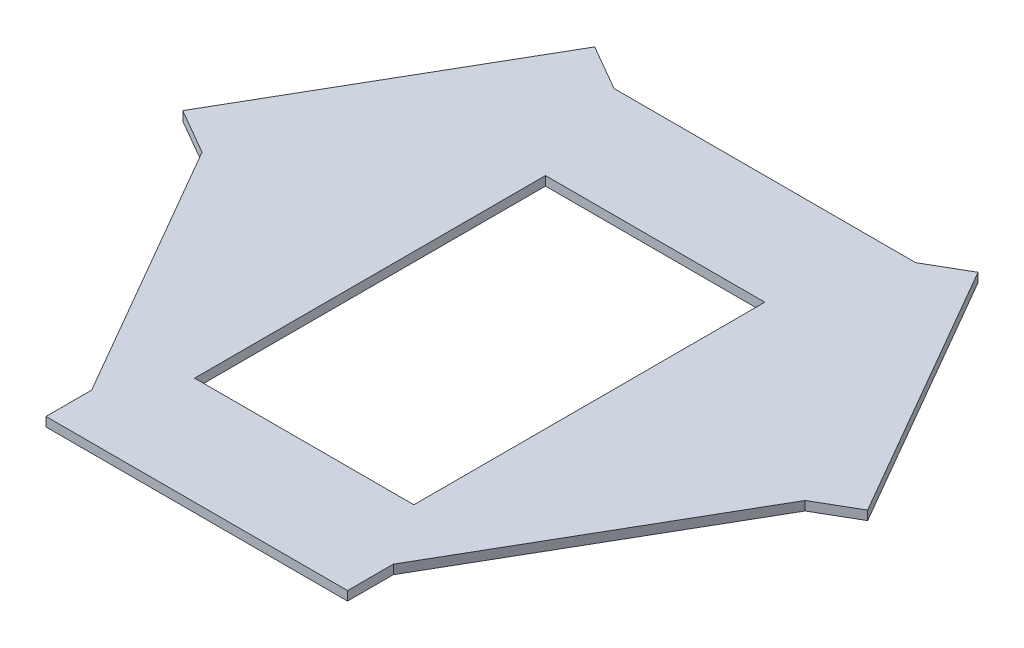
ISO-10303-21;
HEADER;
FILE_DESCRIPTION(('STEP AP214'),'2;1');
FILE_NAME('part.step','',(''),(''),'','','');
FILE_SCHEMA(('AUTOMOTIVE_DESIGN { 1 0 10303 214 1 1 1 1 }'));
ENDSEC;
DATA;
#1=APPLICATION_CONTEXT('core data for automotive mechanical design processes');
#2=APPLICATION_PROTOCOL_DEFINITION('international standard','automotive_design',2000,#1);
#3=PRODUCT_CONTEXT('',#1,'mechanical');
#4=PRODUCT('Part','Part','',(#3));
#5=PRODUCT_RELATED_PRODUCT_CATEGORY('part','',(#4));
#6=PRODUCT_DEFINITION_FORMATION('','',#4);
#7=PRODUCT_DEFINITION_CONTEXT('part definition',#1,'design');
#8=PRODUCT_DEFINITION('design','',#6,#7);
#9=PRODUCT_DEFINITION_SHAPE('','',#8);
#10=(LENGTH_UNIT() NAMED_UNIT(*) SI_UNIT(.MILLI.,.METRE.));
#11=(NAMED_UNIT(*) PLANE_ANGLE_UNIT() SI_UNIT($,.RADIAN.));
#12=(NAMED_UNIT(*) SI_UNIT($,.STERADIAN.) SOLID_ANGLE_UNIT());
#13=UNCERTAINTY_MEASURE_WITH_UNIT(LENGTH_MEASURE(1.E-05),#10,'distance_accuracy_value','');
#14=(GEOMETRIC_REPRESENTATION_CONTEXT(3) GLOBAL_UNCERTAINTY_ASSIGNED_CONTEXT((#13)) GLOBAL_UNIT_ASSIGNED_CONTEXT((#10,
#11,#12)) REPRESENTATION_CONTEXT('',''));
#15=CARTESIAN_POINT('',(0.,0.,0.));
#16=DIRECTION('',(0.,0.,1.));
#17=DIRECTION('',(1.,0.,0.));
#18=AXIS2_PLACEMENT_3D('',#15,#16,#17);
#19=CARTESIAN_POINT('',(-123.75,5.,71.4470958122161));
#20=DIRECTION('',(0.866025403784439,0.,-0.5));
#21=DIRECTION('',(-0.5,0.,-0.866025403784439));
#22=AXIS2_PLACEMENT_3D('',#19,#20,#21);
#23=PLANE('',#22);
#24=DIRECTION('',(0.5,0.,0.866025403784439));
#25=VECTOR('',#24,1.);
#26=CARTESIAN_POINT('',(-123.75,0.,71.4470958122161));
#27=LINE('',#26,#25);
#28=CARTESIAN_POINT('',(-165.,0.,0.));
#29=VERTEX_POINT('',#28);
#30=CARTESIAN_POINT('',(-82.5000000000001,0.,142.894191624432));
#31=VERTEX_POINT('',#30);
#32=EDGE_CURVE('E197',#29,#31,#27,.T.);
#33=ORIENTED_EDGE('',*,*,#32,.T.);
#34=DIRECTION('',(0.,-1.,0.));
#35=VECTOR('',#34,1.);
#36=CARTESIAN_POINT('',(-82.5000000000001,5.,142.894191624432));
#37=LINE('',#36,#35);
#38=CARTESIAN_POINT('',(-82.5000000000001,5.,142.894191624432));
#39=VERTEX_POINT('',#38);
#40=EDGE_CURVE('E11',#39,#31,#37,.T.);
#41=ORIENTED_EDGE('',*,*,#40,.F.);
#42=DIRECTION('',(0.5,0.,0.866025403784439));
#43=VECTOR('',#42,1.);
#44=CARTESIAN_POINT('',(-123.75,5.,71.4470958122161));
#45=LINE('',#44,#43);
#46=CARTESIAN_POINT('',(-165.,5.,0.));
#47=VERTEX_POINT('',#46);
#48=EDGE_CURVE('E270',#47,#39,#45,.T.);
#49=ORIENTED_EDGE('',*,*,#48,.F.);
#50=DIRECTION('',(0.,-1.,0.));
#51=VECTOR('',#50,1.);
#52=CARTESIAN_POINT('',(-165.,5.,0.));
#53=LINE('',#52,#51);
#54=EDGE_CURVE('E54',#47,#29,#53,.T.);
#55=ORIENTED_EDGE('',*,*,#54,.T.);
#56=EDGE_LOOP('',(#33,#41,#49,#55));
#57=FACE_BOUND('',#56,.T.);
#58=ADVANCED_FACE('F35',(#57),#23,.F.);
#59=CARTESIAN_POINT('',(-82.5000000000001,5.,0.));
#60=DIRECTION('',(1.,0.,0.));
#61=DIRECTION('',(0.,0.,-1.));
#62=AXIS2_PLACEMENT_3D('',#59,#60,#61);
#63=PLANE('',#62);
#64=DIRECTION('',(0.,0.,1.));
#65=VECTOR('',#64,1.);
#66=CARTESIAN_POINT('',(-82.5000000000001,0.,0.));
#67=LINE('',#66,#65);
#68=CARTESIAN_POINT('',(-82.5000000000001,0.,167.894191624432));
#69=VERTEX_POINT('',#68);
#70=EDGE_CURVE('E199',#31,#69,#67,.T.);
#71=ORIENTED_EDGE('',*,*,#70,.T.);
#72=DIRECTION('',(0.,-1.,0.));
#73=VECTOR('',#72,1.);
#74=CARTESIAN_POINT('',(-82.5000000000001,5.,167.894191624432));
#75=LINE('',#74,#73);
#76=CARTESIAN_POINT('',(-82.5000000000001,5.,167.894191624432));
#77=VERTEX_POINT('',#76);
#78=EDGE_CURVE('E45',#77,#69,#75,.T.);
#79=ORIENTED_EDGE('',*,*,#78,.F.);
#80=DIRECTION('',(0.,0.,1.));
#81=VECTOR('',#80,1.);
#82=CARTESIAN_POINT('',(-82.5000000000001,5.,0.));
#83=LINE('',#82,#81);
#84=EDGE_CURVE('E273',#39,#77,#83,.T.);
#85=ORIENTED_EDGE('',*,*,#84,.F.);
#86=ORIENTED_EDGE('',*,*,#40,.T.);
#87=EDGE_LOOP('',(#71,#79,#85,#86));
#88=FACE_BOUND('',#87,.T.);
#89=ADVANCED_FACE('F315',(#88),#63,.F.);
#90=CARTESIAN_POINT('',(0.,5.,167.894191624432));
#91=DIRECTION('',(0.,0.,-1.));
#92=DIRECTION('',(-1.,0.,0.));
#93=AXIS2_PLACEMENT_3D('',#90,#91,#92);
#94=PLANE('',#93);
#95=DIRECTION('',(1.,0.,0.));
#96=VECTOR('',#95,1.);
#97=CARTESIAN_POINT('',(0.,0.,167.894191624432));
#98=LINE('',#97,#96);
#99=CARTESIAN_POINT('',(82.5,0.,167.894191624432));
#100=VERTEX_POINT('',#99);
#101=EDGE_CURVE('E201',#69,#100,#98,.T.);
#102=ORIENTED_EDGE('',*,*,#101,.T.);
#103=DIRECTION('',(0.,-1.,0.));
#104=VECTOR('',#103,1.);
#105=CARTESIAN_POINT('',(82.5,5.,167.894191624432));
#106=LINE('',#105,#104);
#107=CARTESIAN_POINT('',(82.5,5.,167.894191624432));
#108=VERTEX_POINT('',#107);
#109=EDGE_CURVE('E241',#108,#100,#106,.T.);
#110=ORIENTED_EDGE('',*,*,#109,.F.);
#111=DIRECTION('',(1.,0.,0.));
#112=VECTOR('',#111,1.);
#113=CARTESIAN_POINT('',(0.,5.,167.894191624432));
#114=LINE('',#113,#112);
#115=EDGE_CURVE('E279',#77,#108,#114,.T.);
#116=ORIENTED_EDGE('',*,*,#115,.F.);
#117=ORIENTED_EDGE('',*,*,#78,.T.);
#118=EDGE_LOOP('',(#102,#110,#116,#117));
#119=FACE_BOUND('',#118,.T.);
#120=ADVANCED_FACE('F320',(#119),#94,.F.);
#121=CARTESIAN_POINT('',(82.4999999999999,5.,0.));
#122=DIRECTION('',(1.,0.,0.));
#123=DIRECTION('',(0.,0.,-1.));
#124=AXIS2_PLACEMENT_3D('',#121,#122,#123);
#125=PLANE('',#124);
#126=DIRECTION('',(0.,0.,1.));
#127=VECTOR('',#126,1.);
#128=CARTESIAN_POINT('',(82.4999999999999,0.,0.));
#129=LINE('',#128,#127);
#130=CARTESIAN_POINT('',(82.5,0.,142.894191624432));
#131=VERTEX_POINT('',#130);
#132=EDGE_CURVE('E204',#131,#100,#129,.T.);
#133=ORIENTED_EDGE('',*,*,#132,.F.);
#134=DIRECTION('',(0.,-1.,0.));
#135=VECTOR('',#134,1.);
#136=CARTESIAN_POINT('',(82.5,5.,142.894191624432));
#137=LINE('',#136,#135);
#138=CARTESIAN_POINT('',(82.5,5.,142.894191624432));
#139=VERTEX_POINT('',#138);
#140=EDGE_CURVE('E239',#139,#131,#137,.T.);
#141=ORIENTED_EDGE('',*,*,#140,.F.);
#142=DIRECTION('',(0.,0.,1.));
#143=VECTOR('',#142,1.);
#144=CARTESIAN_POINT('',(82.4999999999999,5.,0.));
#145=LINE('',#144,#143);
#146=EDGE_CURVE('E281',#139,#108,#145,.T.);
#147=ORIENTED_EDGE('',*,*,#146,.T.);
#148=ORIENTED_EDGE('',*,*,#109,.T.);
#149=EDGE_LOOP('',(#133,#141,#147,#148));
#150=FACE_BOUND('',#149,.T.);
#151=ADVANCED_FACE('F441',(#150),#125,.T.);
#152=CARTESIAN_POINT('',(123.75,5.,71.4470958122162));
#153=DIRECTION('',(-0.866025403784439,0.,-0.5));
#154=DIRECTION('',(-0.5,0.,0.866025403784439));
#155=AXIS2_PLACEMENT_3D('',#152,#153,#154);
#156=PLANE('',#155);
#157=DIRECTION('',(0.5,0.,-0.866025403784439));
#158=VECTOR('',#157,1.);
#159=CARTESIAN_POINT('',(123.75,0.,71.4470958122162));
#160=LINE('',#159,#158);
#161=CARTESIAN_POINT('',(165.,0.,0.));
#162=VERTEX_POINT('',#161);
#163=EDGE_CURVE('E207',#131,#162,#160,.T.);
#164=ORIENTED_EDGE('',*,*,#163,.T.);
#165=DIRECTION('',(0.,-1.,0.));
#166=VECTOR('',#165,1.);
#167=CARTESIAN_POINT('',(165.,5.,0.));
#168=LINE('',#167,#166);
#169=CARTESIAN_POINT('',(165.,5.,0.));
#170=VERTEX_POINT('',#169);
#171=EDGE_CURVE('E236',#170,#162,#168,.T.);
#172=ORIENTED_EDGE('',*,*,#171,.F.);
#173=DIRECTION('',(0.5,0.,-0.866025403784439));
#174=VECTOR('',#173,1.);
#175=CARTESIAN_POINT('',(123.75,5.,71.4470958122162));
#176=LINE('',#175,#174);
#177=EDGE_CURVE('E284',#139,#170,#176,.T.);
#178=ORIENTED_EDGE('',*,*,#177,.F.);
#179=ORIENTED_EDGE('',*,*,#140,.T.);
#180=EDGE_LOOP('',(#164,#172,#178,#179));
#181=FACE_BOUND('',#180,.T.);
#182=ADVANCED_FACE('F432',(#181),#156,.F.);
#183=CARTESIAN_POINT('',(41.2499999999999,5.,71.4470958122162));
#184=DIRECTION('',(-0.499999999999999,0.,-0.866025403784439));
#185=DIRECTION('',(-0.866025403784439,0.,0.499999999999999));
#186=AXIS2_PLACEMENT_3D('',#183,#184,#185);
#187=PLANE('',#186);
#188=DIRECTION('',(0.866025403784439,0.,-0.499999999999999));
#189=VECTOR('',#188,1.);
#190=CARTESIAN_POINT('',(41.2499999999999,0.,71.4470958122162));
#191=LINE('',#190,#189);
#192=CARTESIAN_POINT('',(186.650635094611,0.,-12.4999999999999));
#193=VERTEX_POINT('',#192);
#194=EDGE_CURVE('E209',#162,#193,#191,.T.);
#195=ORIENTED_EDGE('',*,*,#194,.T.);
#196=DIRECTION('',(0.,-1.,0.));
#197=VECTOR('',#196,1.);
#198=CARTESIAN_POINT('',(186.650635094611,5.,-12.4999999999999));
#199=LINE('',#198,#197);
#200=CARTESIAN_POINT('',(186.650635094611,5.,-12.4999999999999));
#201=VERTEX_POINT('',#200);
#202=EDGE_CURVE('E234',#201,#193,#199,.T.);
#203=ORIENTED_EDGE('',*,*,#202,.F.);
#204=DIRECTION('',(0.866025403784439,0.,-0.499999999999999));
#205=VECTOR('',#204,1.);
#206=CARTESIAN_POINT('',(41.2499999999999,5.,71.4470958122162));
#207=LINE('',#206,#205);
#208=EDGE_CURVE('E286',#170,#201,#207,.T.);
#209=ORIENTED_EDGE('',*,*,#208,.F.);
#210=ORIENTED_EDGE('',*,*,#171,.T.);
#211=EDGE_LOOP('',(#195,#203,#209,#210));
#212=FACE_BOUND('',#211,.T.);
#213=ADVANCED_FACE('F424',(#212),#187,.F.);
#214=CARTESIAN_POINT('',(145.400635094611,5.,-83.9470958122161));
#215=DIRECTION('',(0.866025403784439,0.,-0.5));
#216=DIRECTION('',(-0.5,0.,-0.866025403784439));
#217=AXIS2_PLACEMENT_3D('',#214,#215,#216);
#218=PLANE('',#217);
#219=DIRECTION('',(0.5,0.,0.866025403784439));
#220=VECTOR('',#219,1.);
#221=CARTESIAN_POINT('',(145.400635094611,0.,-83.9470958122161));
#222=LINE('',#221,#220);
#223=CARTESIAN_POINT('',(104.150635094611,0.,-155.394191624432));
#224=VERTEX_POINT('',#223);
#225=EDGE_CURVE('E212',#224,#193,#222,.T.);
#226=ORIENTED_EDGE('',*,*,#225,.F.);
#227=DIRECTION('',(0.,-1.,0.));
#228=VECTOR('',#227,1.);
#229=CARTESIAN_POINT('',(104.150635094611,5.,-155.394191624432));
#230=LINE('',#229,#228);
#231=CARTESIAN_POINT('',(104.150635094611,5.,-155.394191624432));
#232=VERTEX_POINT('',#231);
#233=EDGE_CURVE('E232',#232,#224,#230,.T.);
#234=ORIENTED_EDGE('',*,*,#233,.F.);
#235=DIRECTION('',(0.5,0.,0.866025403784439));
#236=VECTOR('',#235,1.);
#237=CARTESIAN_POINT('',(145.400635094611,5.,-83.9470958122161));
#238=LINE('',#237,#236);
#239=EDGE_CURVE('E288',#232,#201,#238,.T.);
#240=ORIENTED_EDGE('',*,*,#239,.T.);
#241=ORIENTED_EDGE('',*,*,#202,.T.);
#242=EDGE_LOOP('',(#226,#234,#240,#241));
#243=FACE_BOUND('',#242,.T.);
#244=ADVANCED_FACE('F301',(#243),#218,.T.);
#245=CARTESIAN_POINT('',(-41.25,5.,-71.4470958122162));
#246=DIRECTION('',(-0.5,0.,-0.866025403784439));
#247=DIRECTION('',(-0.866025403784439,0.,0.5));
#248=AXIS2_PLACEMENT_3D('',#245,#246,#247);
#249=PLANE('',#248);
#250=DIRECTION('',(0.866025403784439,0.,-0.5));
#251=VECTOR('',#250,1.);
#252=CARTESIAN_POINT('',(-41.25,0.,-71.4470958122162));
#253=LINE('',#252,#251);
#254=CARTESIAN_POINT('',(82.5000000000001,0.,-142.894191624432));
#255=VERTEX_POINT('',#254);
#256=EDGE_CURVE('E215',#255,#224,#253,.T.);
#257=ORIENTED_EDGE('',*,*,#256,.F.);
#258=DIRECTION('',(0.,-1.,0.));
#259=VECTOR('',#258,1.);
#260=CARTESIAN_POINT('',(82.5000000000001,5.,-142.894191624432));
#261=LINE('',#260,#259);
#262=CARTESIAN_POINT('',(82.5000000000001,5.,-142.894191624432));
#263=VERTEX_POINT('',#262);
#264=EDGE_CURVE('E230',#263,#255,#261,.T.);
#265=ORIENTED_EDGE('',*,*,#264,.F.);
#266=DIRECTION('',(0.866025403784439,0.,-0.5));
#267=VECTOR('',#266,1.);
#268=CARTESIAN_POINT('',(-41.25,5.,-71.4470958122162));
#269=LINE('',#268,#267);
#270=EDGE_CURVE('E291',#263,#232,#269,.T.);
#271=ORIENTED_EDGE('',*,*,#270,.T.);
#272=ORIENTED_EDGE('',*,*,#233,.T.);
#273=EDGE_LOOP('',(#257,#265,#271,#272));
#274=FACE_BOUND('',#273,.T.);
#275=ADVANCED_FACE('F295',(#274),#249,.T.);
#276=CARTESIAN_POINT('',(0.,5.,-142.894191624432));
#277=DIRECTION('',(0.,0.,1.));
#278=DIRECTION('',(1.,0.,0.));
#279=AXIS2_PLACEMENT_3D('',#276,#277,#278);
#280=PLANE('',#279);
#281=DIRECTION('',(-1.,0.,0.));
#282=VECTOR('',#281,1.);
#283=CARTESIAN_POINT('',(0.,0.,-142.894191624432));
#284=LINE('',#283,#282);
#285=CARTESIAN_POINT('',(-82.5,0.,-142.894191624432));
#286=VERTEX_POINT('',#285);
#287=EDGE_CURVE('E218',#255,#286,#284,.T.);
#288=ORIENTED_EDGE('',*,*,#287,.T.);
#289=DIRECTION('',(0.,-1.,0.));
#290=VECTOR('',#289,1.);
#291=CARTESIAN_POINT('',(-82.5,5.,-142.894191624432));
#292=LINE('',#291,#290);
#293=CARTESIAN_POINT('',(-82.5,5.,-142.894191624432));
#294=VERTEX_POINT('',#293);
#295=EDGE_CURVE('E177',#294,#286,#292,.T.);
#296=ORIENTED_EDGE('',*,*,#295,.F.);
#297=DIRECTION('',(-1.,0.,0.));
#298=VECTOR('',#297,1.);
#299=CARTESIAN_POINT('',(0.,5.,-142.894191624432));
#300=LINE('',#299,#298);
#301=EDGE_CURVE('E165',#263,#294,#300,.T.);
#302=ORIENTED_EDGE('',*,*,#301,.F.);
#303=ORIENTED_EDGE('',*,*,#264,.T.);
#304=EDGE_LOOP('',(#288,#296,#302,#303));
#305=FACE_BOUND('',#304,.T.);
#306=ADVANCED_FACE('F305',(#305),#280,.F.);
#307=CARTESIAN_POINT('',(41.25,5.,-71.4470958122163));
#308=DIRECTION('',(-0.5,0.,0.866025403784439));
#309=DIRECTION('',(0.866025403784439,0.,0.5));
#310=AXIS2_PLACEMENT_3D('',#307,#308,#309);
#311=PLANE('',#310);
#312=DIRECTION('',(-0.866025403784439,0.,-0.5));
#313=VECTOR('',#312,1.);
#314=CARTESIAN_POINT('',(41.25,0.,-71.4470958122163));
#315=LINE('',#314,#313);
#316=CARTESIAN_POINT('',(-107.5,0.,-157.327948354173));
#317=VERTEX_POINT('',#316);
#318=EDGE_CURVE('E174',#286,#317,#315,.T.);
#319=ORIENTED_EDGE('',*,*,#318,.T.);
#320=DIRECTION('',(0.,-1.,0.));
#321=VECTOR('',#320,1.);
#322=CARTESIAN_POINT('',(-107.5,5.,-157.327948354173));
#323=LINE('',#322,#321);
#324=CARTESIAN_POINT('',(-107.5,5.,-157.327948354173));
#325=VERTEX_POINT('',#324);
#326=EDGE_CURVE('E171',#325,#317,#323,.T.);
#327=ORIENTED_EDGE('',*,*,#326,.F.);
#328=DIRECTION('',(-0.866025403784439,0.,-0.5));
#329=VECTOR('',#328,1.);
#330=CARTESIAN_POINT('',(41.25,5.,-71.4470958122163));
#331=LINE('',#330,#329);
#332=EDGE_CURVE('E156',#294,#325,#331,.T.);
#333=ORIENTED_EDGE('',*,*,#332,.F.);
#334=ORIENTED_EDGE('',*,*,#295,.T.);
#335=EDGE_LOOP('',(#319,#327,#333,#334));
#336=FACE_BOUND('',#335,.T.);
#337=ADVANCED_FACE('F172',(#336),#311,.F.);
#338=CARTESIAN_POINT('',(-148.75,5.,-85.880852541957));
#339=DIRECTION('',(0.866025403784438,0.,0.500000000000001));
#340=DIRECTION('',(0.500000000000001,0.,-0.866025403784438));
#341=AXIS2_PLACEMENT_3D('',#338,#339,#340);
#342=PLANE('',#341);
#343=DIRECTION('',(-0.500000000000001,0.,0.866025403784438));
#344=VECTOR('',#343,1.);
#345=CARTESIAN_POINT('',(-148.75,0.,-85.880852541957));
#346=LINE('',#345,#344);
#347=CARTESIAN_POINT('',(-190.,0.,-14.4337567297407));
#348=VERTEX_POINT('',#347);
#349=EDGE_CURVE('E221',#317,#348,#346,.T.);
#350=ORIENTED_EDGE('',*,*,#349,.T.);
#351=DIRECTION('',(0.,-1.,0.));
#352=VECTOR('',#351,1.);
#353=CARTESIAN_POINT('',(-190.,5.,-14.4337567297407));
#354=LINE('',#353,#352);
#355=CARTESIAN_POINT('',(-190.,5.,-14.4337567297407));
#356=VERTEX_POINT('',#355);
#357=EDGE_CURVE('E105',#356,#348,#354,.T.);
#358=ORIENTED_EDGE('',*,*,#357,.F.);
#359=DIRECTION('',(-0.500000000000001,0.,0.866025403784438));
#360=VECTOR('',#359,1.);
#361=CARTESIAN_POINT('',(-148.75,5.,-85.880852541957));
#362=LINE('',#361,#360);
#363=EDGE_CURVE('E162',#325,#356,#362,.T.);
#364=ORIENTED_EDGE('',*,*,#363,.F.);
#365=ORIENTED_EDGE('',*,*,#326,.T.);
#366=EDGE_LOOP('',(#350,#358,#364,#365));
#367=FACE_BOUND('',#366,.T.);
#368=ADVANCED_FACE('F179',(#367),#342,.F.);
#369=CARTESIAN_POINT('',(0.,5.,109.105808375568));
#370=DIRECTION('',(0.,0.,-1.));
#371=DIRECTION('',(-1.,0.,0.));
#372=AXIS2_PLACEMENT_3D('',#369,#370,#371);
#373=PLANE('',#372);
#374=DIRECTION('',(1.,0.,0.));
#375=VECTOR('',#374,1.);
#376=CARTESIAN_POINT('',(0.,0.,109.105808375568));
#377=LINE('',#376,#375);
#378=CARTESIAN_POINT('',(-60.0000000000001,0.,109.105808375568));
#379=VERTEX_POINT('',#378);
#380=CARTESIAN_POINT('',(59.9999999999999,0.,109.105808375568));
#381=VERTEX_POINT('',#380);
#382=EDGE_CURVE('E186',#379,#381,#377,.T.);
#383=ORIENTED_EDGE('',*,*,#382,.F.);
#384=DIRECTION('',(0.,-1.,0.));
#385=VECTOR('',#384,1.);
#386=CARTESIAN_POINT('',(-60.0000000000001,5.,109.105808375568));
#387=LINE('',#386,#385);
#388=CARTESIAN_POINT('',(-60.0000000000001,5.,109.105808375568));
#389=VERTEX_POINT('',#388);
#390=EDGE_CURVE('E39',#389,#379,#387,.T.);
#391=ORIENTED_EDGE('',*,*,#390,.F.);
#392=DIRECTION('',(1.,0.,0.));
#393=VECTOR('',#392,1.);
#394=CARTESIAN_POINT('',(0.,5.,109.105808375568));
#395=LINE('',#394,#393);
#396=CARTESIAN_POINT('',(59.9999999999999,5.,109.105808375568));
#397=VERTEX_POINT('',#396);
#398=EDGE_CURVE('E226',#389,#397,#395,.T.);
#399=ORIENTED_EDGE('',*,*,#398,.T.);
#400=DIRECTION('',(0.,-1.,0.));
#401=VECTOR('',#400,1.);
#402=CARTESIAN_POINT('',(59.9999999999999,5.,109.105808375568));
#403=LINE('',#402,#401);
#404=EDGE_CURVE('E182',#397,#381,#403,.T.);
#405=ORIENTED_EDGE('',*,*,#404,.T.);
#406=EDGE_LOOP('',(#383,#391,#399,#405));
#407=FACE_BOUND('',#406,.T.);
#408=ADVANCED_FACE('F37',(#407),#373,.T.);
#409=CARTESIAN_POINT('',(-60.0000000000001,5.,0.));
#410=DIRECTION('',(1.,0.,0.));
#411=DIRECTION('',(0.,0.,-1.));
#412=AXIS2_PLACEMENT_3D('',#409,#410,#411);
#413=PLANE('',#412);
#414=DIRECTION('',(0.,0.,1.));
#415=VECTOR('',#414,1.);
#416=CARTESIAN_POINT('',(-60.0000000000001,0.,0.));
#417=LINE('',#416,#415);
#418=CARTESIAN_POINT('',(-60.0000000000001,0.,-82.8941916244324));
#419=VERTEX_POINT('',#418);
#420=EDGE_CURVE('E189',#419,#379,#417,.T.);
#421=ORIENTED_EDGE('',*,*,#420,.F.);
#422=DIRECTION('',(0.,-1.,0.));
#423=VECTOR('',#422,1.);
#424=CARTESIAN_POINT('',(-60.0000000000001,5.,-82.8941916244324));
#425=LINE('',#424,#423);
#426=CARTESIAN_POINT('',(-60.0000000000001,5.,-82.8941916244324));
#427=VERTEX_POINT('',#426);
#428=EDGE_CURVE('E248',#427,#419,#425,.T.);
#429=ORIENTED_EDGE('',*,*,#428,.F.);
#430=DIRECTION('',(0.,0.,1.));
#431=VECTOR('',#430,1.);
#432=CARTESIAN_POINT('',(-60.0000000000001,5.,0.));
#433=LINE('',#432,#431);
#434=EDGE_CURVE('E257',#427,#389,#433,.T.);
#435=ORIENTED_EDGE('',*,*,#434,.T.);
#436=ORIENTED_EDGE('',*,*,#390,.T.);
#437=EDGE_LOOP('',(#421,#429,#435,#436));
#438=FACE_BOUND('',#437,.T.);
#439=ADVANCED_FACE('F255',(#438),#413,.T.);
#440=CARTESIAN_POINT('',(0.,5.,-82.8941916244324));
#441=DIRECTION('',(0.,0.,-1.));
#442=DIRECTION('',(-1.,0.,0.));
#443=AXIS2_PLACEMENT_3D('',#440,#441,#442);
#444=PLANE('',#443);
#445=DIRECTION('',(1.,0.,0.));
#446=VECTOR('',#445,1.);
#447=CARTESIAN_POINT('',(0.,0.,-82.8941916244324));
#448=LINE('',#447,#446);
#449=CARTESIAN_POINT('',(59.9999999999999,0.,-82.8941916244324));
#450=VERTEX_POINT('',#449);
#451=EDGE_CURVE('E192',#419,#450,#448,.T.);
#452=ORIENTED_EDGE('',*,*,#451,.T.);
#453=DIRECTION('',(0.,-1.,0.));
#454=VECTOR('',#453,1.);
#455=CARTESIAN_POINT('',(59.9999999999999,5.,-82.8941916244324));
#456=LINE('',#455,#454);
#457=CARTESIAN_POINT('',(59.9999999999999,5.,-82.8941916244324));
#458=VERTEX_POINT('',#457);
#459=EDGE_CURVE('E246',#458,#450,#456,.T.);
#460=ORIENTED_EDGE('',*,*,#459,.F.);
#461=DIRECTION('',(1.,0.,0.));
#462=VECTOR('',#461,1.);
#463=CARTESIAN_POINT('',(0.,5.,-82.8941916244324));
#464=LINE('',#463,#462);
#465=EDGE_CURVE('E271',#427,#458,#464,.T.);
#466=ORIENTED_EDGE('',*,*,#465,.F.);
#467=ORIENTED_EDGE('',*,*,#428,.T.);
#468=EDGE_LOOP('',(#452,#460,#466,#467));
#469=FACE_BOUND('',#468,.T.);
#470=ADVANCED_FACE('F264',(#469),#444,.F.);
#471=CARTESIAN_POINT('',(59.9999999999999,5.,0.));
#472=DIRECTION('',(1.,0.,0.));
#473=DIRECTION('',(0.,0.,-1.));
#474=AXIS2_PLACEMENT_3D('',#471,#472,#473);
#475=PLANE('',#474);
#476=DIRECTION('',(0.,0.,1.));
#477=VECTOR('',#476,1.);
#478=CARTESIAN_POINT('',(59.9999999999999,0.,0.));
#479=LINE('',#478,#477);
#480=EDGE_CURVE('E194',#450,#381,#479,.T.);
#481=ORIENTED_EDGE('',*,*,#480,.T.);
#482=ORIENTED_EDGE('',*,*,#404,.F.);
#483=DIRECTION('',(0.,0.,1.));
#484=VECTOR('',#483,1.);
#485=CARTESIAN_POINT('',(59.9999999999999,5.,0.));
#486=LINE('',#485,#484);
#487=EDGE_CURVE('E268',#458,#397,#486,.T.);
#488=ORIENTED_EDGE('',*,*,#487,.F.);
#489=ORIENTED_EDGE('',*,*,#459,.T.);
#490=EDGE_LOOP('',(#481,#482,#488,#489));
#491=FACE_BOUND('',#490,.T.);
#492=ADVANCED_FACE('F267',(#491),#475,.F.);
#493=CARTESIAN_POINT('',(-41.2499999999999,5.,71.4470958122161));
#494=DIRECTION('',(-0.5,0.,0.866025403784439));
#495=DIRECTION('',(0.866025403784439,0.,0.5));
#496=AXIS2_PLACEMENT_3D('',#493,#494,#495);
#497=PLANE('',#496);
#498=DIRECTION('',(-0.866025403784439,0.,-0.5));
#499=VECTOR('',#498,1.);
#500=CARTESIAN_POINT('',(-41.2499999999999,0.,71.4470958122161));
#501=LINE('',#500,#499);
#502=EDGE_CURVE('E223',#29,#348,#501,.T.);
#503=ORIENTED_EDGE('',*,*,#502,.F.);
#504=ORIENTED_EDGE('',*,*,#54,.F.);
#505=DIRECTION('',(-0.866025403784439,0.,-0.5));
#506=VECTOR('',#505,1.);
#507=CARTESIAN_POINT('',(-41.2499999999999,5.,71.4470958122161));
#508=LINE('',#507,#506);
#509=EDGE_CURVE('E180',#47,#356,#508,.T.);
#510=ORIENTED_EDGE('',*,*,#509,.T.);
#511=ORIENTED_EDGE('',*,*,#357,.T.);
#512=EDGE_LOOP('',(#503,#504,#510,#511));
#513=FACE_BOUND('',#512,.T.);
#514=ADVANCED_FACE('F327',(#513),#497,.T.);
#515=CARTESIAN_POINT('',(0.,5.,0.));
#516=DIRECTION('',(0.,1.,0.));
#517=DIRECTION('',(0.,0.,1.));
#518=AXIS2_PLACEMENT_3D('',#515,#516,#517);
#519=PLANE('',#518);
#520=ORIENTED_EDGE('',*,*,#398,.F.);
#521=ORIENTED_EDGE('',*,*,#434,.F.);
#522=ORIENTED_EDGE('',*,*,#465,.T.);
#523=ORIENTED_EDGE('',*,*,#487,.T.);
#524=EDGE_LOOP('',(#520,#521,#522,#523));
#525=FACE_BOUND('',#524,.T.);
#526=ORIENTED_EDGE('',*,*,#48,.T.);
#527=ORIENTED_EDGE('',*,*,#84,.T.);
#528=ORIENTED_EDGE('',*,*,#115,.T.);
#529=ORIENTED_EDGE('',*,*,#146,.F.);
#530=ORIENTED_EDGE('',*,*,#177,.T.);
#531=ORIENTED_EDGE('',*,*,#208,.T.);
#532=ORIENTED_EDGE('',*,*,#239,.F.);
#533=ORIENTED_EDGE('',*,*,#270,.F.);
#534=ORIENTED_EDGE('',*,*,#301,.T.);
#535=ORIENTED_EDGE('',*,*,#332,.T.);
#536=ORIENTED_EDGE('',*,*,#363,.T.);
#537=ORIENTED_EDGE('',*,*,#509,.F.);
#538=EDGE_LOOP('',(#526,#527,#528,#529,#530,#531,#532,#533,#534,#535,#536,#537));
#539=FACE_BOUND('',#538,.T.);
#540=ADVANCED_FACE('F159',(#525,#539),#519,.T.);
#541=CARTESIAN_POINT('',(0.,0.,0.));
#542=DIRECTION('',(0.,1.,0.));
#543=DIRECTION('',(0.,0.,1.));
#544=AXIS2_PLACEMENT_3D('',#541,#542,#543);
#545=PLANE('',#544);
#546=ORIENTED_EDGE('',*,*,#382,.T.);
#547=ORIENTED_EDGE('',*,*,#480,.F.);
#548=ORIENTED_EDGE('',*,*,#451,.F.);
#549=ORIENTED_EDGE('',*,*,#420,.T.);
#550=EDGE_LOOP('',(#546,#547,#548,#549));
#551=FACE_BOUND('',#550,.T.);
#552=ORIENTED_EDGE('',*,*,#32,.F.);
#553=ORIENTED_EDGE('',*,*,#502,.T.);
#554=ORIENTED_EDGE('',*,*,#349,.F.);
#555=ORIENTED_EDGE('',*,*,#318,.F.);
#556=ORIENTED_EDGE('',*,*,#287,.F.);
#557=ORIENTED_EDGE('',*,*,#256,.T.);
#558=ORIENTED_EDGE('',*,*,#225,.T.);
#559=ORIENTED_EDGE('',*,*,#194,.F.);
#560=ORIENTED_EDGE('',*,*,#163,.F.);
#561=ORIENTED_EDGE('',*,*,#132,.T.);
#562=ORIENTED_EDGE('',*,*,#101,.F.);
#563=ORIENTED_EDGE('',*,*,#70,.F.);
#564=EDGE_LOOP('',(#552,#553,#554,#555,#556,#557,#558,#559,#560,#561,#562,#563));
#565=FACE_BOUND('',#564,.T.);
#566=ADVANCED_FACE('F261',(#551,#565),#545,.F.);
#567=CLOSED_SHELL('',(#58,#89,#120,#151,#182,#213,#244,#275,#306,#337,#368,#408,#439,#470,#492,
#514,#540,#566));
#568=MANIFOLD_SOLID_BREP('B2',#567);
#569=ADVANCED_BREP_SHAPE_REPRESENTATION('',(#18,#568),#14);
#570=SHAPE_DEFINITION_REPRESENTATION(#9,#569);
ENDSEC;
END-ISO-10303-21;
